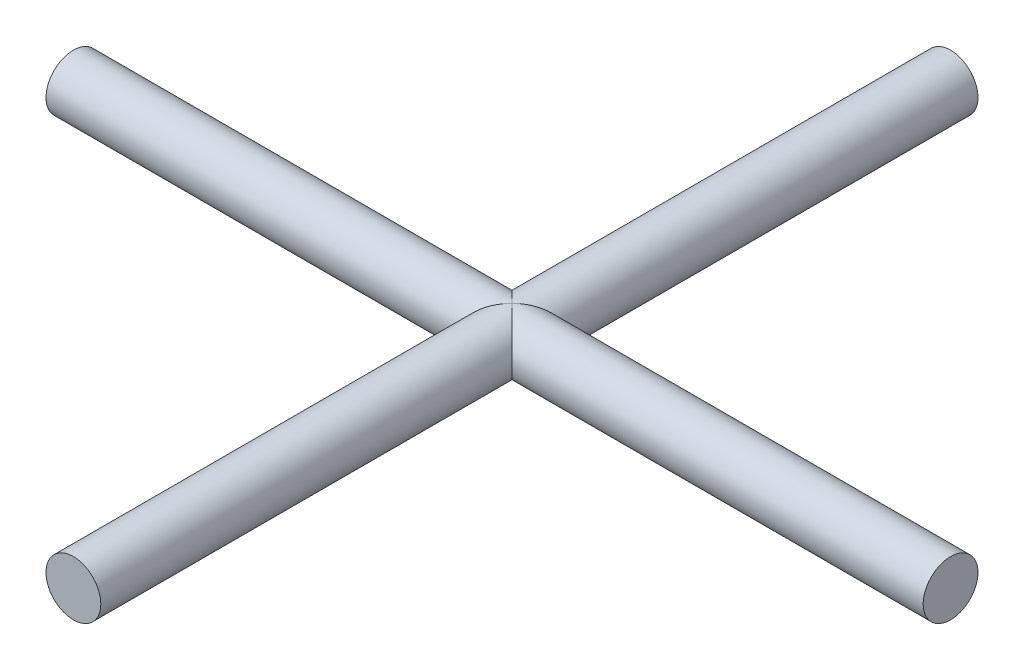
ISO-10303-21;
HEADER;
FILE_DESCRIPTION(('STEP AP214'),'2;1');
FILE_NAME('part.step','',(''),(''),'','','');
FILE_SCHEMA(('AUTOMOTIVE_DESIGN { 1 0 10303 214 1 1 1 1 }'));
ENDSEC;
DATA;
#1=APPLICATION_CONTEXT('core data for automotive mechanical design processes');
#2=APPLICATION_PROTOCOL_DEFINITION('international standard','automotive_design',2000,#1);
#3=PRODUCT_CONTEXT('',#1,'mechanical');
#4=PRODUCT('Part','Part','',(#3));
#5=PRODUCT_RELATED_PRODUCT_CATEGORY('part','',(#4));
#6=PRODUCT_DEFINITION_FORMATION('','',#4);
#7=PRODUCT_DEFINITION_CONTEXT('part definition',#1,'design');
#8=PRODUCT_DEFINITION('design','',#6,#7);
#9=PRODUCT_DEFINITION_SHAPE('','',#8);
#10=(LENGTH_UNIT() NAMED_UNIT(*) SI_UNIT(.MILLI.,.METRE.));
#11=(NAMED_UNIT(*) PLANE_ANGLE_UNIT() SI_UNIT($,.RADIAN.));
#12=(NAMED_UNIT(*) SI_UNIT($,.STERADIAN.) SOLID_ANGLE_UNIT());
#13=UNCERTAINTY_MEASURE_WITH_UNIT(LENGTH_MEASURE(1.E-05),#10,'distance_accuracy_value','');
#14=(GEOMETRIC_REPRESENTATION_CONTEXT(3) GLOBAL_UNCERTAINTY_ASSIGNED_CONTEXT((#13)) GLOBAL_UNIT_ASSIGNED_CONTEXT((#10,
#11,#12)) REPRESENTATION_CONTEXT('',''));
#15=CARTESIAN_POINT('',(0.,0.,0.));
#16=DIRECTION('',(0.,0.,1.));
#17=DIRECTION('',(1.,0.,0.));
#18=AXIS2_PLACEMENT_3D('',#15,#16,#17);
#19=CARTESIAN_POINT('',(0.,0.,40.));
#20=DIRECTION('',(0.,0.,-1.));
#21=DIRECTION('',(-1.,0.,0.));
#22=AXIS2_PLACEMENT_3D('',#19,#20,#21);
#23=CYLINDRICAL_SURFACE('',#22,2.5);
#24=CARTESIAN_POINT('',(0.,0.,40.));
#25=DIRECTION('',(0.,0.,1.));
#26=DIRECTION('',(1.,0.,0.));
#27=AXIS2_PLACEMENT_3D('',#24,#25,#26);
#28=CIRCLE('',#27,2.5);
#29=CARTESIAN_POINT('',(2.5,0.,40.));
#30=VERTEX_POINT('',#29);
#31=EDGE_CURVE('E58',#30,#30,#28,.T.);
#32=ORIENTED_EDGE('',*,*,#31,.F.);
#33=EDGE_LOOP('',(#32));
#34=FACE_BOUND('',#33,.T.);
#35=CARTESIAN_POINT('',(0.,0.,0.));
#36=DIRECTION('',(-0.707106781186547,0.,-0.707106781186547));
#37=DIRECTION('',(0.707106781186547,0.,-0.707106781186547));
#38=AXIS2_PLACEMENT_3D('',#35,#36,#37);
#39=ELLIPSE('',#38,3.53553390593274,2.5);
#40=CARTESIAN_POINT('',(0.,-2.5,0.));
#41=VERTEX_POINT('',#40);
#42=CARTESIAN_POINT('',(0.,2.5,0.));
#43=VERTEX_POINT('',#42);
#44=EDGE_CURVE('E42',#41,#43,#39,.T.);
#45=ORIENTED_EDGE('',*,*,#44,.F.);
#46=CARTESIAN_POINT('',(0.,0.,0.));
#47=DIRECTION('',(0.707106781186547,0.,-0.707106781186547));
#48=DIRECTION('',(-0.707106781186547,0.,-0.707106781186547));
#49=AXIS2_PLACEMENT_3D('',#46,#47,#48);
#50=ELLIPSE('',#49,3.53553390593274,2.5);
#51=EDGE_CURVE('E54',#43,#41,#50,.T.);
#52=ORIENTED_EDGE('',*,*,#51,.F.);
#53=EDGE_LOOP('',(#45,#52));
#54=FACE_BOUND('',#53,.T.);
#55=ADVANCED_FACE('F34',(#34,#54),#23,.T.);
#56=CARTESIAN_POINT('',(0.,0.,40.));
#57=DIRECTION('',(0.,0.,1.));
#58=DIRECTION('',(1.,0.,0.));
#59=AXIS2_PLACEMENT_3D('',#56,#57,#58);
#60=PLANE('',#59);
#61=ORIENTED_EDGE('',*,*,#31,.T.);
#62=EDGE_LOOP('',(#61));
#63=FACE_BOUND('',#62,.T.);
#64=ADVANCED_FACE('F81',(#63),#60,.T.);
#65=CARTESIAN_POINT('',(-40.,0.,0.));
#66=DIRECTION('',(1.,0.,0.));
#67=DIRECTION('',(0.,0.,-1.));
#68=AXIS2_PLACEMENT_3D('',#65,#66,#67);
#69=PLANE('',#68);
#70=CARTESIAN_POINT('',(-40.,0.,0.));
#71=DIRECTION('',(1.,0.,0.));
#72=DIRECTION('',(0.,0.,-1.));
#73=AXIS2_PLACEMENT_3D('',#70,#71,#72);
#74=CIRCLE('',#73,2.5);
#75=CARTESIAN_POINT('',(-40.,0.,-2.5));
#76=VERTEX_POINT('',#75);
#77=EDGE_CURVE('E95',#76,#76,#74,.T.);
#78=ORIENTED_EDGE('',*,*,#77,.F.);
#79=EDGE_LOOP('',(#78));
#80=FACE_BOUND('',#79,.T.);
#81=ADVANCED_FACE('F78',(#80),#69,.F.);
#82=CARTESIAN_POINT('',(40.,0.,0.));
#83=DIRECTION('',(-1.,0.,0.));
#84=DIRECTION('',(0.,0.,1.));
#85=AXIS2_PLACEMENT_3D('',#82,#83,#84);
#86=CYLINDRICAL_SURFACE('',#85,2.5);
#87=ORIENTED_EDGE('',*,*,#77,.T.);
#88=EDGE_LOOP('',(#87));
#89=FACE_BOUND('',#88,.T.);
#90=CARTESIAN_POINT('',(0.,0.,0.));
#91=DIRECTION('',(0.707106781186547,0.,-0.707106781186547));
#92=DIRECTION('',(-0.707106781186547,0.,-0.707106781186547));
#93=AXIS2_PLACEMENT_3D('',#90,#91,#92);
#94=ELLIPSE('',#93,3.53553390593274,2.5);
#95=EDGE_CURVE('E48',#43,#41,#94,.F.);
#96=ORIENTED_EDGE('',*,*,#95,.T.);
#97=ORIENTED_EDGE('',*,*,#44,.T.);
#98=EDGE_LOOP('',(#96,#97));
#99=FACE_BOUND('',#98,.T.);
#100=ADVANCED_FACE('F60',(#89,#99),#86,.T.);
#101=CARTESIAN_POINT('',(0.,0.,-40.));
#102=DIRECTION('',(0.,0.,1.));
#103=DIRECTION('',(1.,0.,0.));
#104=AXIS2_PLACEMENT_3D('',#101,#102,#103);
#105=PLANE('',#104);
#106=CARTESIAN_POINT('',(0.,0.,-40.));
#107=DIRECTION('',(0.,0.,1.));
#108=DIRECTION('',(1.,0.,0.));
#109=AXIS2_PLACEMENT_3D('',#106,#107,#108);
#110=CIRCLE('',#109,2.5);
#111=CARTESIAN_POINT('',(2.5,0.,-40.));
#112=VERTEX_POINT('',#111);
#113=EDGE_CURVE('E89',#112,#112,#110,.T.);
#114=ORIENTED_EDGE('',*,*,#113,.F.);
#115=EDGE_LOOP('',(#114));
#116=FACE_BOUND('',#115,.T.);
#117=ADVANCED_FACE('F72',(#116),#105,.F.);
#118=ORIENTED_EDGE('',*,*,#113,.T.);
#119=EDGE_LOOP('',(#118));
#120=FACE_BOUND('',#119,.T.);
#121=CARTESIAN_POINT('',(0.,0.,0.));
#122=DIRECTION('',(-0.707106781186547,0.,-0.707106781186547));
#123=DIRECTION('',(0.707106781186547,0.,-0.707106781186547));
#124=AXIS2_PLACEMENT_3D('',#121,#122,#123);
#125=ELLIPSE('',#124,3.53553390593274,2.5);
#126=EDGE_CURVE('E11',#41,#43,#125,.F.);
#127=ORIENTED_EDGE('',*,*,#126,.F.);
#128=ORIENTED_EDGE('',*,*,#95,.F.);
#129=EDGE_LOOP('',(#127,#128));
#130=FACE_BOUND('',#129,.T.);
#131=ADVANCED_FACE('F36',(#120,#130),#23,.T.);
#132=CARTESIAN_POINT('',(40.,0.,0.));
#133=DIRECTION('',(1.,0.,0.));
#134=DIRECTION('',(0.,0.,-1.));
#135=AXIS2_PLACEMENT_3D('',#132,#133,#134);
#136=CIRCLE('',#135,2.5);
#137=CARTESIAN_POINT('',(40.,0.,-2.5));
#138=VERTEX_POINT('',#137);
#139=EDGE_CURVE('E92',#138,#138,#136,.T.);
#140=ORIENTED_EDGE('',*,*,#139,.F.);
#141=EDGE_LOOP('',(#140));
#142=FACE_BOUND('',#141,.T.);
#143=ORIENTED_EDGE('',*,*,#51,.T.);
#144=ORIENTED_EDGE('',*,*,#126,.T.);
#145=EDGE_LOOP('',(#143,#144));
#146=FACE_BOUND('',#145,.T.);
#147=ADVANCED_FACE('F61',(#142,#146),#86,.T.);
#148=CARTESIAN_POINT('',(40.,0.,0.));
#149=DIRECTION('',(1.,0.,0.));
#150=DIRECTION('',(0.,0.,-1.));
#151=AXIS2_PLACEMENT_3D('',#148,#149,#150);
#152=PLANE('',#151);
#153=ORIENTED_EDGE('',*,*,#139,.T.);
#154=EDGE_LOOP('',(#153));
#155=FACE_BOUND('',#154,.T.);
#156=ADVANCED_FACE('F63',(#155),#152,.T.);
#157=CLOSED_SHELL('',(#55,#64,#81,#100,#117,#131,#147,#156));
#158=MANIFOLD_SOLID_BREP('B2',#157);
#159=ADVANCED_BREP_SHAPE_REPRESENTATION('',(#18,#158),#14);
#160=SHAPE_DEFINITION_REPRESENTATION(#9,#159);
ENDSEC;
END-ISO-10303-21;
